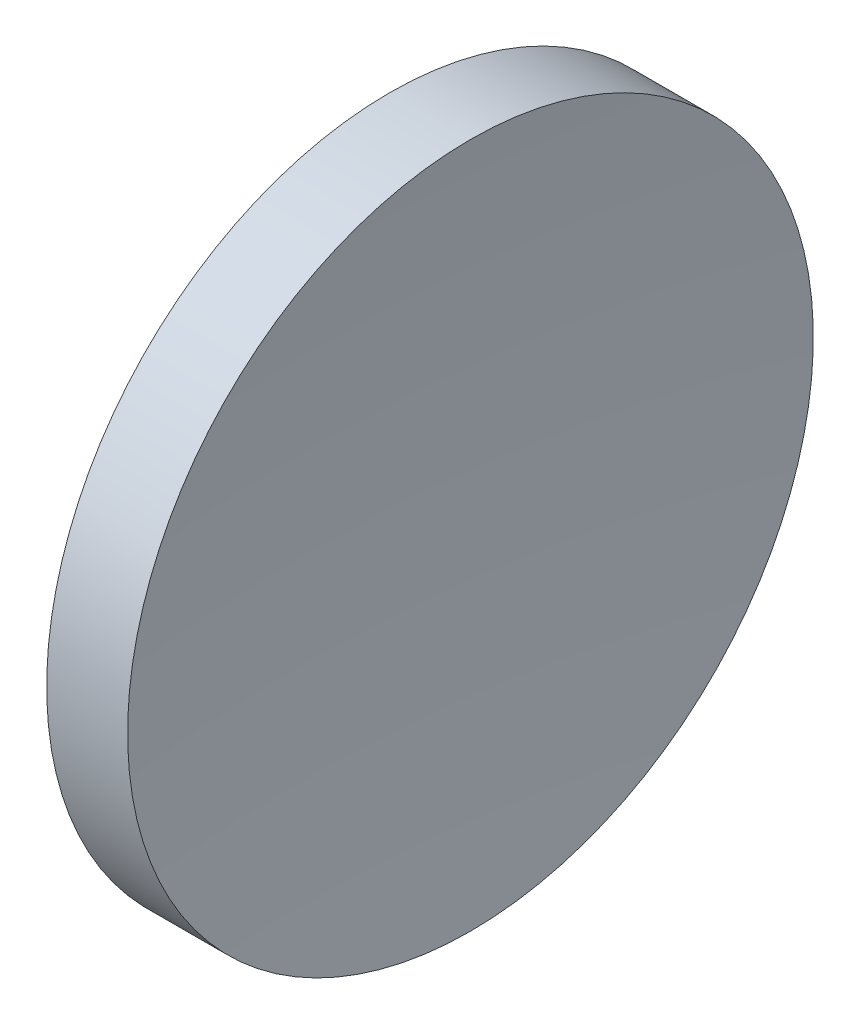
ISO-10303-21;
HEADER;
FILE_DESCRIPTION(('STEP AP214'),'2;1');
FILE_NAME('part.step','',(''),(''),'','','');
FILE_SCHEMA(('AUTOMOTIVE_DESIGN { 1 0 10303 214 1 1 1 1 }'));
ENDSEC;
DATA;
#1=APPLICATION_CONTEXT('core data for automotive mechanical design processes');
#2=APPLICATION_PROTOCOL_DEFINITION('international standard','automotive_design',2000,#1);
#3=PRODUCT_CONTEXT('',#1,'mechanical');
#4=PRODUCT('Part','Part','',(#3));
#5=PRODUCT_RELATED_PRODUCT_CATEGORY('part','',(#4));
#6=PRODUCT_DEFINITION_FORMATION('','',#4);
#7=PRODUCT_DEFINITION_CONTEXT('part definition',#1,'design');
#8=PRODUCT_DEFINITION('design','',#6,#7);
#9=PRODUCT_DEFINITION_SHAPE('','',#8);
#10=(LENGTH_UNIT() NAMED_UNIT(*) SI_UNIT(.MILLI.,.METRE.));
#11=(NAMED_UNIT(*) PLANE_ANGLE_UNIT() SI_UNIT($,.RADIAN.));
#12=(NAMED_UNIT(*) SI_UNIT($,.STERADIAN.) SOLID_ANGLE_UNIT());
#13=UNCERTAINTY_MEASURE_WITH_UNIT(LENGTH_MEASURE(1.E-05),#10,'distance_accuracy_value','');
#14=(GEOMETRIC_REPRESENTATION_CONTEXT(3) GLOBAL_UNCERTAINTY_ASSIGNED_CONTEXT((#13)) GLOBAL_UNIT_ASSIGNED_CONTEXT((#10,
#11,#12)) REPRESENTATION_CONTEXT('',''));
#15=CARTESIAN_POINT('',(0.,0.,0.));
#16=DIRECTION('',(0.,0.,1.));
#17=DIRECTION('',(1.,0.,0.));
#18=AXIS2_PLACEMENT_3D('',#15,#16,#17);
#19=CARTESIAN_POINT('',(128.974422626175,26.0621617113864,0.));
#20=DIRECTION('',(0.,0.,-1.));
#21=DIRECTION('',(0.,-1.,0.));
#22=AXIS2_PLACEMENT_3D('',#19,#20,#21);
#23=CIRCLE('',#22,82.62);
#24=TRIMMED_CURVE('',#23,(PARAMETER_VALUE(-1.57079742182539)),
(PARAMETER_VALUE(1.57079742182539)),.T.,.PARAMETER.);
#25=CARTESIAN_POINT('',(128.974422626175,26.062252182806,0.));
#26=DIRECTION('',(-1.,0.,0.));
#27=AXIS1_PLACEMENT('',#25,#26);
#28=SURFACE_OF_REVOLUTION('',#24,#27);
#29=CARTESIAN_POINT('',(46.742641376256,26.0622521828061,0.));
#30=DIRECTION('',(-1.,0.,0.));
#31=DIRECTION('',(0.,-1.,0.));
#32=AXIS2_PLACEMENT_3D('',#29,#30,#31);
#33=CIRCLE('',#32,8.);
#34=CARTESIAN_POINT('',(46.742641376256,18.0622521828061,0.));
#35=VERTEX_POINT('',#34);
#36=EDGE_CURVE('E11',#35,#35,#33,.T.);
#37=ORIENTED_EDGE('',*,*,#36,.F.);
#38=EDGE_LOOP('',(#37));
#39=FACE_BOUND('',#38,.T.);
#40=CARTESIAN_POINT('',(46.3544226262245,26.0622521828061,0.));
#41=VERTEX_POINT('',#40);
#42=VERTEX_LOOP('',#41);
#43=FACE_BOUND('',#42,.T.);
#44=ADVANCED_FACE('F37',(#39,#43),#28,.F.);
#45=CARTESIAN_POINT('',(43.0119502361649,26.0622521828061,0.));
#46=DIRECTION('',(-1.,0.,0.));
#47=DIRECTION('',(0.,-1.,0.));
#48=AXIS2_PLACEMENT_3D('',#45,#46,#47);
#49=CYLINDRICAL_SURFACE('',#48,8.);
#50=CARTESIAN_POINT('',(44.8544226262245,26.0622521828061,0.));
#51=DIRECTION('',(-1.,0.,0.));
#52=DIRECTION('',(0.,-1.,0.));
#53=AXIS2_PLACEMENT_3D('',#50,#51,#52);
#54=CIRCLE('',#53,8.);
#55=CARTESIAN_POINT('',(44.8544226262245,18.0622521828061,0.));
#56=VERTEX_POINT('',#55);
#57=EDGE_CURVE('E43',#56,#56,#54,.T.);
#58=ORIENTED_EDGE('',*,*,#57,.F.);
#59=EDGE_LOOP('',(#58));
#60=FACE_BOUND('',#59,.T.);
#61=ORIENTED_EDGE('',*,*,#36,.T.);
#62=EDGE_LOOP('',(#61));
#63=FACE_BOUND('',#62,.T.);
#64=ADVANCED_FACE('F47',(#60,#63),#49,.T.);
#65=CARTESIAN_POINT('',(44.8544226262245,26.0622521828061,0.));
#66=DIRECTION('',(1.,0.,0.));
#67=DIRECTION('',(0.,1.,0.));
#68=AXIS2_PLACEMENT_3D('',#65,#66,#67);
#69=PLANE('',#68);
#70=ORIENTED_EDGE('',*,*,#57,.T.);
#71=EDGE_LOOP('',(#70));
#72=FACE_BOUND('',#71,.T.);
#73=ADVANCED_FACE('F52',(#72),#69,.F.);
#74=CLOSED_SHELL('',(#44,#64,#73));
#75=MANIFOLD_SOLID_BREP('B2',#74);
#76=ADVANCED_BREP_SHAPE_REPRESENTATION('',(#18,#75),#14);
#77=SHAPE_DEFINITION_REPRESENTATION(#9,#76);
ENDSEC;
END-ISO-10303-21;
